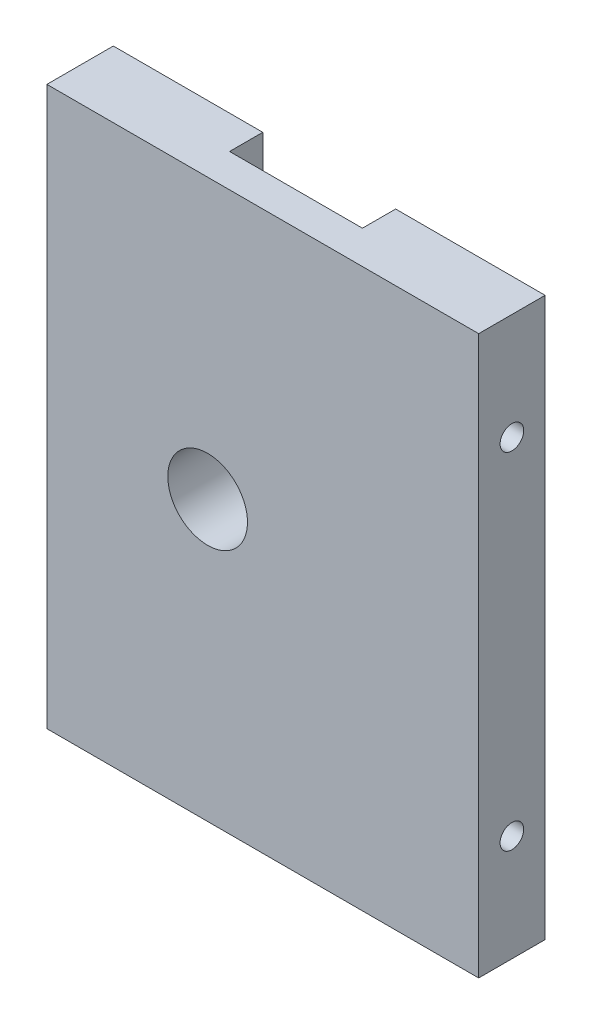
ISO-10303-21;
HEADER;
FILE_DESCRIPTION(('STEP AP214'),'2;1');
FILE_NAME('part.step','',(''),(''),'','','');
FILE_SCHEMA(('AUTOMOTIVE_DESIGN { 1 0 10303 214 1 1 1 1 }'));
ENDSEC;
DATA;
#1=APPLICATION_CONTEXT('core data for automotive mechanical design processes');
#2=APPLICATION_PROTOCOL_DEFINITION('international standard','automotive_design',2000,#1);
#3=PRODUCT_CONTEXT('',#1,'mechanical');
#4=PRODUCT('Part','Part','',(#3));
#5=PRODUCT_RELATED_PRODUCT_CATEGORY('part','',(#4));
#6=PRODUCT_DEFINITION_FORMATION('','',#4);
#7=PRODUCT_DEFINITION_CONTEXT('part definition',#1,'design');
#8=PRODUCT_DEFINITION('design','',#6,#7);
#9=PRODUCT_DEFINITION_SHAPE('','',#8);
#10=(LENGTH_UNIT() NAMED_UNIT(*) SI_UNIT(.MILLI.,.METRE.));
#11=(NAMED_UNIT(*) PLANE_ANGLE_UNIT() SI_UNIT($,.RADIAN.));
#12=(NAMED_UNIT(*) SI_UNIT($,.STERADIAN.) SOLID_ANGLE_UNIT());
#13=UNCERTAINTY_MEASURE_WITH_UNIT(LENGTH_MEASURE(1.E-05),#10,'distance_accuracy_value','');
#14=(GEOMETRIC_REPRESENTATION_CONTEXT(3) GLOBAL_UNCERTAINTY_ASSIGNED_CONTEXT((#13)) GLOBAL_UNIT_ASSIGNED_CONTEXT((#10,
#11,#12)) REPRESENTATION_CONTEXT('',''));
#15=CARTESIAN_POINT('',(0.,0.,0.));
#16=DIRECTION('',(0.,0.,1.));
#17=DIRECTION('',(1.,0.,0.));
#18=AXIS2_PLACEMENT_3D('',#15,#16,#17);
#19=CARTESIAN_POINT('',(0.,42.,5.));
#20=DIRECTION('',(0.,-1.,0.));
#21=DIRECTION('',(0.,0.,-1.));
#22=AXIS2_PLACEMENT_3D('',#19,#20,#21);
#23=PLANE('',#22);
#24=DIRECTION('',(0.,0.,-1.));
#25=VECTOR('',#24,1.);
#26=CARTESIAN_POINT('',(21.25,42.,2.5));
#27=LINE('',#26,#25);
#28=CARTESIAN_POINT('',(21.25,42.,2.5));
#29=VERTEX_POINT('',#28);
#30=CARTESIAN_POINT('',(21.25,42.,0.));
#31=VERTEX_POINT('',#30);
#32=EDGE_CURVE('E170',#29,#31,#27,.T.);
#33=ORIENTED_EDGE('',*,*,#32,.F.);
#34=DIRECTION('',(1.,0.,0.));
#35=VECTOR('',#34,1.);
#36=CARTESIAN_POINT('',(0.,42.,2.5));
#37=LINE('',#36,#35);
#38=CARTESIAN_POINT('',(11.25,42.,2.5));
#39=VERTEX_POINT('',#38);
#40=EDGE_CURVE('E149',#39,#29,#37,.T.);
#41=ORIENTED_EDGE('',*,*,#40,.F.);
#42=DIRECTION('',(0.,0.,-1.));
#43=VECTOR('',#42,1.);
#44=CARTESIAN_POINT('',(11.25,42.,2.5));
#45=LINE('',#44,#43);
#46=CARTESIAN_POINT('',(11.25,42.,0.));
#47=VERTEX_POINT('',#46);
#48=EDGE_CURVE('E174',#39,#47,#45,.T.);
#49=ORIENTED_EDGE('',*,*,#48,.T.);
#50=DIRECTION('',(-1.,0.,0.));
#51=VECTOR('',#50,1.);
#52=CARTESIAN_POINT('',(0.,42.,0.));
#53=LINE('',#52,#51);
#54=CARTESIAN_POINT('',(0.,42.,0.));
#55=VERTEX_POINT('',#54);
#56=EDGE_CURVE('E91',#47,#55,#53,.T.);
#57=ORIENTED_EDGE('',*,*,#56,.T.);
#58=DIRECTION('',(0.,0.,-1.));
#59=VECTOR('',#58,1.);
#60=CARTESIAN_POINT('',(0.,42.,5.));
#61=LINE('',#60,#59);
#62=CARTESIAN_POINT('',(0.,42.,5.));
#63=VERTEX_POINT('',#62);
#64=EDGE_CURVE('E230',#63,#55,#61,.T.);
#65=ORIENTED_EDGE('',*,*,#64,.F.);
#66=DIRECTION('',(-1.,0.,0.));
#67=VECTOR('',#66,1.);
#68=CARTESIAN_POINT('',(0.,42.,5.));
#69=LINE('',#68,#67);
#70=CARTESIAN_POINT('',(32.5,42.,5.));
#71=VERTEX_POINT('',#70);
#72=EDGE_CURVE('E70',#71,#63,#69,.T.);
#73=ORIENTED_EDGE('',*,*,#72,.F.);
#74=DIRECTION('',(0.,0.,-1.));
#75=VECTOR('',#74,1.);
#76=CARTESIAN_POINT('',(32.5,42.,5.));
#77=LINE('',#76,#75);
#78=CARTESIAN_POINT('',(32.5,42.,0.));
#79=VERTEX_POINT('',#78);
#80=EDGE_CURVE('E245',#71,#79,#77,.T.);
#81=ORIENTED_EDGE('',*,*,#80,.T.);
#82=EDGE_CURVE('E222',#79,#31,#53,.T.);
#83=ORIENTED_EDGE('',*,*,#82,.T.);
#84=EDGE_LOOP('',(#33,#41,#49,#57,#65,#73,#81,#83));
#85=FACE_BOUND('',#84,.T.);
#86=ADVANCED_FACE('F45',(#85),#23,.F.);
#87=CARTESIAN_POINT('',(0.,0.,0.));
#88=DIRECTION('',(0.,0.,-1.));
#89=DIRECTION('',(-1.,0.,0.));
#90=AXIS2_PLACEMENT_3D('',#87,#88,#89);
#91=PLANE('',#90);
#92=CARTESIAN_POINT('',(12.1,21.,0.));
#93=DIRECTION('',(0.,0.,-1.));
#94=DIRECTION('',(-1.,0.,0.));
#95=AXIS2_PLACEMENT_3D('',#92,#93,#94);
#96=CIRCLE('',#95,3.);
#97=CARTESIAN_POINT('',(9.1,21.,0.));
#98=VERTEX_POINT('',#97);
#99=EDGE_CURVE('E173',#98,#98,#96,.T.);
#100=ORIENTED_EDGE('',*,*,#99,.F.);
#101=EDGE_LOOP('',(#100));
#102=FACE_BOUND('',#101,.T.);
#103=DIRECTION('',(1.,0.,0.));
#104=VECTOR('',#103,1.);
#105=CARTESIAN_POINT('',(0.,35.5,0.));
#106=LINE('',#105,#104);
#107=CARTESIAN_POINT('',(11.25,35.5,0.));
#108=VERTEX_POINT('',#107);
#109=CARTESIAN_POINT('',(21.25,35.5,0.));
#110=VERTEX_POINT('',#109);
#111=EDGE_CURVE('E159',#108,#110,#106,.T.);
#112=ORIENTED_EDGE('',*,*,#111,.T.);
#113=DIRECTION('',(0.,1.,0.));
#114=VECTOR('',#113,1.);
#115=CARTESIAN_POINT('',(21.25,0.,0.));
#116=LINE('',#115,#114);
#117=EDGE_CURVE('E61',#110,#31,#116,.T.);
#118=ORIENTED_EDGE('',*,*,#117,.T.);
#119=ORIENTED_EDGE('',*,*,#82,.F.);
#120=DIRECTION('',(0.,1.,0.));
#121=VECTOR('',#120,1.);
#122=CARTESIAN_POINT('',(32.5,0.,0.));
#123=LINE('',#122,#121);
#124=CARTESIAN_POINT('',(32.5,0.,0.));
#125=VERTEX_POINT('',#124);
#126=EDGE_CURVE('E237',#125,#79,#123,.T.);
#127=ORIENTED_EDGE('',*,*,#126,.F.);
#128=DIRECTION('',(1.,0.,0.));
#129=VECTOR('',#128,1.);
#130=CARTESIAN_POINT('',(0.,0.,0.));
#131=LINE('',#130,#129);
#132=CARTESIAN_POINT('',(0.,0.,0.));
#133=VERTEX_POINT('',#132);
#134=EDGE_CURVE('E234',#133,#125,#131,.T.);
#135=ORIENTED_EDGE('',*,*,#134,.F.);
#136=DIRECTION('',(0.,-1.,0.));
#137=VECTOR('',#136,1.);
#138=CARTESIAN_POINT('',(0.,0.,0.));
#139=LINE('',#138,#137);
#140=EDGE_CURVE('E218',#55,#133,#139,.T.);
#141=ORIENTED_EDGE('',*,*,#140,.F.);
#142=ORIENTED_EDGE('',*,*,#56,.F.);
#143=DIRECTION('',(0.,-1.,0.));
#144=VECTOR('',#143,1.);
#145=CARTESIAN_POINT('',(11.25,0.,0.));
#146=LINE('',#145,#144);
#147=EDGE_CURVE('E155',#47,#108,#146,.T.);
#148=ORIENTED_EDGE('',*,*,#147,.T.);
#149=EDGE_LOOP('',(#112,#118,#119,#127,#135,#141,#142,#148));
#150=FACE_BOUND('',#149,.T.);
#151=ADVANCED_FACE('F257',(#102,#150),#91,.T.);
#152=CARTESIAN_POINT('',(0.,0.,5.));
#153=DIRECTION('',(1.,0.,0.));
#154=DIRECTION('',(0.,0.,-1.));
#155=AXIS2_PLACEMENT_3D('',#152,#153,#154);
#156=PLANE('',#155);
#157=CARTESIAN_POINT('',(0.,34.,2.5));
#158=DIRECTION('',(-1.,0.,0.));
#159=DIRECTION('',(0.,0.,1.));
#160=AXIS2_PLACEMENT_3D('',#157,#158,#159);
#161=CIRCLE('',#160,0.889000000000001);
#162=CARTESIAN_POINT('',(0.,34.,3.389));
#163=VERTEX_POINT('',#162);
#164=EDGE_CURVE('E202',#163,#163,#161,.T.);
#165=ORIENTED_EDGE('',*,*,#164,.F.);
#166=EDGE_LOOP('',(#165));
#167=FACE_BOUND('',#166,.T.);
#168=CARTESIAN_POINT('',(0.,8.,2.5));
#169=DIRECTION('',(-1.,0.,0.));
#170=DIRECTION('',(0.,0.,1.));
#171=AXIS2_PLACEMENT_3D('',#168,#169,#170);
#172=CIRCLE('',#171,0.888999999999999);
#173=CARTESIAN_POINT('',(0.,8.,3.389));
#174=VERTEX_POINT('',#173);
#175=EDGE_CURVE('E210',#174,#174,#172,.T.);
#176=ORIENTED_EDGE('',*,*,#175,.F.);
#177=EDGE_LOOP('',(#176));
#178=FACE_BOUND('',#177,.T.);
#179=ORIENTED_EDGE('',*,*,#140,.T.);
#180=DIRECTION('',(0.,0.,-1.));
#181=VECTOR('',#180,1.);
#182=CARTESIAN_POINT('',(0.,0.,5.));
#183=LINE('',#182,#181);
#184=CARTESIAN_POINT('',(0.,0.,5.));
#185=VERTEX_POINT('',#184);
#186=EDGE_CURVE('E11',#185,#133,#183,.T.);
#187=ORIENTED_EDGE('',*,*,#186,.F.);
#188=DIRECTION('',(0.,-1.,0.));
#189=VECTOR('',#188,1.);
#190=CARTESIAN_POINT('',(0.,0.,5.));
#191=LINE('',#190,#189);
#192=EDGE_CURVE('E219',#63,#185,#191,.T.);
#193=ORIENTED_EDGE('',*,*,#192,.F.);
#194=ORIENTED_EDGE('',*,*,#64,.T.);
#195=EDGE_LOOP('',(#179,#187,#193,#194));
#196=FACE_BOUND('',#195,.T.);
#197=ADVANCED_FACE('F47',(#167,#178,#196),#156,.F.);
#198=CARTESIAN_POINT('',(0.,0.,5.));
#199=DIRECTION('',(0.,1.,0.));
#200=DIRECTION('',(0.,0.,1.));
#201=AXIS2_PLACEMENT_3D('',#198,#199,#200);
#202=PLANE('',#201);
#203=ORIENTED_EDGE('',*,*,#134,.T.);
#204=DIRECTION('',(0.,0.,-1.));
#205=VECTOR('',#204,1.);
#206=CARTESIAN_POINT('',(32.5,0.,5.));
#207=LINE('',#206,#205);
#208=CARTESIAN_POINT('',(32.5,0.,5.));
#209=VERTEX_POINT('',#208);
#210=EDGE_CURVE('E54',#209,#125,#207,.T.);
#211=ORIENTED_EDGE('',*,*,#210,.F.);
#212=DIRECTION('',(1.,0.,0.));
#213=VECTOR('',#212,1.);
#214=CARTESIAN_POINT('',(0.,0.,5.));
#215=LINE('',#214,#213);
#216=EDGE_CURVE('E98',#185,#209,#215,.T.);
#217=ORIENTED_EDGE('',*,*,#216,.F.);
#218=ORIENTED_EDGE('',*,*,#186,.T.);
#219=EDGE_LOOP('',(#203,#211,#217,#218));
#220=FACE_BOUND('',#219,.T.);
#221=ADVANCED_FACE('F274',(#220),#202,.F.);
#222=CARTESIAN_POINT('',(32.5,0.,5.));
#223=DIRECTION('',(-1.,0.,0.));
#224=DIRECTION('',(0.,0.,1.));
#225=AXIS2_PLACEMENT_3D('',#222,#223,#224);
#226=PLANE('',#225);
#227=CARTESIAN_POINT('',(32.5,34.,2.5));
#228=DIRECTION('',(1.,0.,0.));
#229=DIRECTION('',(0.,0.,-1.));
#230=AXIS2_PLACEMENT_3D('',#227,#228,#229);
#231=CIRCLE('',#230,0.888999999999987);
#232=CARTESIAN_POINT('',(32.5,34.,1.61100000000001));
#233=VERTEX_POINT('',#232);
#234=EDGE_CURVE('E183',#233,#233,#231,.T.);
#235=ORIENTED_EDGE('',*,*,#234,.F.);
#236=EDGE_LOOP('',(#235));
#237=FACE_BOUND('',#236,.T.);
#238=CARTESIAN_POINT('',(32.5,8.,2.5));
#239=DIRECTION('',(1.,0.,0.));
#240=DIRECTION('',(0.,0.,-1.));
#241=AXIS2_PLACEMENT_3D('',#238,#239,#240);
#242=CIRCLE('',#241,0.888999999999989);
#243=CARTESIAN_POINT('',(32.5,8.,1.61100000000001));
#244=VERTEX_POINT('',#243);
#245=EDGE_CURVE('E194',#244,#244,#242,.T.);
#246=ORIENTED_EDGE('',*,*,#245,.F.);
#247=EDGE_LOOP('',(#246));
#248=FACE_BOUND('',#247,.T.);
#249=ORIENTED_EDGE('',*,*,#126,.T.);
#250=ORIENTED_EDGE('',*,*,#80,.F.);
#251=DIRECTION('',(0.,1.,0.));
#252=VECTOR('',#251,1.);
#253=CARTESIAN_POINT('',(32.5,0.,5.));
#254=LINE('',#253,#252);
#255=EDGE_CURVE('E225',#209,#71,#254,.T.);
#256=ORIENTED_EDGE('',*,*,#255,.F.);
#257=ORIENTED_EDGE('',*,*,#210,.T.);
#258=EDGE_LOOP('',(#249,#250,#256,#257));
#259=FACE_BOUND('',#258,.T.);
#260=ADVANCED_FACE('F253',(#237,#248,#259),#226,.F.);
#261=CARTESIAN_POINT('',(0.,0.,5.));
#262=DIRECTION('',(0.,0.,-1.));
#263=DIRECTION('',(-1.,0.,0.));
#264=AXIS2_PLACEMENT_3D('',#261,#262,#263);
#265=PLANE('',#264);
#266=CARTESIAN_POINT('',(12.1,21.,5.));
#267=DIRECTION('',(0.,0.,-1.));
#268=DIRECTION('',(-1.,0.,0.));
#269=AXIS2_PLACEMENT_3D('',#266,#267,#268);
#270=CIRCLE('',#269,3.);
#271=CARTESIAN_POINT('',(9.1,21.,5.));
#272=VERTEX_POINT('',#271);
#273=EDGE_CURVE('E179',#272,#272,#270,.T.);
#274=ORIENTED_EDGE('',*,*,#273,.T.);
#275=EDGE_LOOP('',(#274));
#276=FACE_BOUND('',#275,.T.);
#277=ORIENTED_EDGE('',*,*,#192,.T.);
#278=ORIENTED_EDGE('',*,*,#216,.T.);
#279=ORIENTED_EDGE('',*,*,#255,.T.);
#280=ORIENTED_EDGE('',*,*,#72,.T.);
#281=EDGE_LOOP('',(#277,#278,#279,#280));
#282=FACE_BOUND('',#281,.T.);
#283=ADVANCED_FACE('F262',(#276,#282),#265,.F.);
#284=CARTESIAN_POINT('',(7.4658349096845,8.,2.5));
#285=DIRECTION('',(-1.,0.,0.));
#286=DIRECTION('',(0.,0.,1.));
#287=AXIS2_PLACEMENT_3D('',#284,#285,#286);
#288=CONICAL_SURFACE('',#287,0.888999999999999,1.02974425867665);
#289=CARTESIAN_POINT('',(8.,8.,2.5));
#290=VERTEX_POINT('',#289);
#291=VERTEX_LOOP('',#290);
#292=FACE_BOUND('',#291,.T.);
#293=CARTESIAN_POINT('',(7.4658349096845,8.,2.5));
#294=DIRECTION('',(-1.,0.,0.));
#295=DIRECTION('',(0.,0.,1.));
#296=AXIS2_PLACEMENT_3D('',#293,#294,#295);
#297=CIRCLE('',#296,0.888999999999999);
#298=CARTESIAN_POINT('',(7.4658349096845,8.,3.389));
#299=VERTEX_POINT('',#298);
#300=EDGE_CURVE('E214',#299,#299,#297,.T.);
#301=ORIENTED_EDGE('',*,*,#300,.T.);
#302=EDGE_LOOP('',(#301));
#303=FACE_BOUND('',#302,.T.);
#304=ADVANCED_FACE('F264',(#292,#303),#288,.F.);
#305=CARTESIAN_POINT('',(0.,8.,2.5));
#306=DIRECTION('',(-1.,0.,0.));
#307=DIRECTION('',(0.,0.,1.));
#308=AXIS2_PLACEMENT_3D('',#305,#306,#307);
#309=CYLINDRICAL_SURFACE('',#308,0.888999999999999);
#310=ORIENTED_EDGE('',*,*,#300,.F.);
#311=EDGE_LOOP('',(#310));
#312=FACE_BOUND('',#311,.T.);
#313=ORIENTED_EDGE('',*,*,#175,.T.);
#314=EDGE_LOOP('',(#313));
#315=FACE_BOUND('',#314,.T.);
#316=ADVANCED_FACE('F271',(#312,#315),#309,.F.);
#317=CARTESIAN_POINT('',(7.4658349096845,34.,2.5));
#318=DIRECTION('',(-1.,0.,0.));
#319=DIRECTION('',(0.,0.,1.));
#320=AXIS2_PLACEMENT_3D('',#317,#318,#319);
#321=CONICAL_SURFACE('',#320,0.889000000000001,1.02974425867665);
#322=CARTESIAN_POINT('',(8.,34.,2.5));
#323=VERTEX_POINT('',#322);
#324=VERTEX_LOOP('',#323);
#325=FACE_BOUND('',#324,.T.);
#326=CARTESIAN_POINT('',(7.4658349096845,34.,2.5));
#327=DIRECTION('',(-1.,0.,0.));
#328=DIRECTION('',(0.,0.,1.));
#329=AXIS2_PLACEMENT_3D('',#326,#327,#328);
#330=CIRCLE('',#329,0.889000000000001);
#331=CARTESIAN_POINT('',(7.4658349096845,34.,3.389));
#332=VERTEX_POINT('',#331);
#333=EDGE_CURVE('E206',#332,#332,#330,.T.);
#334=ORIENTED_EDGE('',*,*,#333,.T.);
#335=EDGE_LOOP('',(#334));
#336=FACE_BOUND('',#335,.T.);
#337=ADVANCED_FACE('F325',(#325,#336),#321,.F.);
#338=CARTESIAN_POINT('',(0.,34.,2.5));
#339=DIRECTION('',(-1.,0.,0.));
#340=DIRECTION('',(0.,0.,1.));
#341=AXIS2_PLACEMENT_3D('',#338,#339,#340);
#342=CYLINDRICAL_SURFACE('',#341,0.889000000000001);
#343=ORIENTED_EDGE('',*,*,#333,.F.);
#344=EDGE_LOOP('',(#343));
#345=FACE_BOUND('',#344,.T.);
#346=ORIENTED_EDGE('',*,*,#164,.T.);
#347=EDGE_LOOP('',(#346));
#348=FACE_BOUND('',#347,.T.);
#349=ADVANCED_FACE('F321',(#345,#348),#342,.F.);
#350=CARTESIAN_POINT('',(25.0341650903155,8.,2.5));
#351=DIRECTION('',(1.,0.,0.));
#352=DIRECTION('',(0.,0.,-1.));
#353=AXIS2_PLACEMENT_3D('',#350,#351,#352);
#354=CONICAL_SURFACE('',#353,0.888999999999999,1.02974425867665);
#355=CARTESIAN_POINT('',(24.5,8.,2.5));
#356=VERTEX_POINT('',#355);
#357=VERTEX_LOOP('',#356);
#358=FACE_BOUND('',#357,.T.);
#359=CARTESIAN_POINT('',(25.0341650903155,8.,2.5));
#360=DIRECTION('',(1.,0.,0.));
#361=DIRECTION('',(0.,0.,-1.));
#362=AXIS2_PLACEMENT_3D('',#359,#360,#361);
#363=CIRCLE('',#362,0.888999999999999);
#364=CARTESIAN_POINT('',(25.0341650903155,8.,1.611));
#365=VERTEX_POINT('',#364);
#366=EDGE_CURVE('E198',#365,#365,#363,.T.);
#367=ORIENTED_EDGE('',*,*,#366,.T.);
#368=EDGE_LOOP('',(#367));
#369=FACE_BOUND('',#368,.T.);
#370=ADVANCED_FACE('F317',(#358,#369),#354,.F.);
#371=CARTESIAN_POINT('',(32.5,8.,2.5));
#372=DIRECTION('',(1.,0.,0.));
#373=DIRECTION('',(0.,0.,-1.));
#374=AXIS2_PLACEMENT_3D('',#371,#372,#373);
#375=CYLINDRICAL_SURFACE('',#374,0.888999999999994);
#376=ORIENTED_EDGE('',*,*,#366,.F.);
#377=EDGE_LOOP('',(#376));
#378=FACE_BOUND('',#377,.T.);
#379=ORIENTED_EDGE('',*,*,#245,.T.);
#380=EDGE_LOOP('',(#379));
#381=FACE_BOUND('',#380,.T.);
#382=ADVANCED_FACE('F313',(#378,#381),#375,.F.);
#383=CARTESIAN_POINT('',(25.0341650903155,34.,2.5));
#384=DIRECTION('',(1.,0.,0.));
#385=DIRECTION('',(0.,0.,-1.));
#386=AXIS2_PLACEMENT_3D('',#383,#384,#385);
#387=CONICAL_SURFACE('',#386,0.889000000000001,1.02974425867665);
#388=CARTESIAN_POINT('',(24.5,34.,2.5));
#389=VERTEX_POINT('',#388);
#390=VERTEX_LOOP('',#389);
#391=FACE_BOUND('',#390,.T.);
#392=CARTESIAN_POINT('',(25.0341650903155,34.,2.5));
#393=DIRECTION('',(1.,0.,0.));
#394=DIRECTION('',(0.,0.,-1.));
#395=AXIS2_PLACEMENT_3D('',#392,#393,#394);
#396=CIRCLE('',#395,0.889000000000001);
#397=CARTESIAN_POINT('',(25.0341650903155,34.,1.611));
#398=VERTEX_POINT('',#397);
#399=EDGE_CURVE('E190',#398,#398,#396,.T.);
#400=ORIENTED_EDGE('',*,*,#399,.T.);
#401=EDGE_LOOP('',(#400));
#402=FACE_BOUND('',#401,.T.);
#403=ADVANCED_FACE('F309',(#391,#402),#387,.F.);
#404=CARTESIAN_POINT('',(32.5,34.,2.5));
#405=DIRECTION('',(1.,0.,0.));
#406=DIRECTION('',(0.,0.,-1.));
#407=AXIS2_PLACEMENT_3D('',#404,#405,#406);
#408=CYLINDRICAL_SURFACE('',#407,0.888999999999994);
#409=ORIENTED_EDGE('',*,*,#399,.F.);
#410=EDGE_LOOP('',(#409));
#411=FACE_BOUND('',#410,.T.);
#412=ORIENTED_EDGE('',*,*,#234,.T.);
#413=EDGE_LOOP('',(#412));
#414=FACE_BOUND('',#413,.T.);
#415=ADVANCED_FACE('F305',(#411,#414),#408,.F.);
#416=CARTESIAN_POINT('',(12.1,21.,5.));
#417=DIRECTION('',(0.,0.,-1.));
#418=DIRECTION('',(-1.,0.,0.));
#419=AXIS2_PLACEMENT_3D('',#416,#417,#418);
#420=CYLINDRICAL_SURFACE('',#419,3.);
#421=ORIENTED_EDGE('',*,*,#273,.F.);
#422=EDGE_LOOP('',(#421));
#423=FACE_BOUND('',#422,.T.);
#424=ORIENTED_EDGE('',*,*,#99,.T.);
#425=EDGE_LOOP('',(#424));
#426=FACE_BOUND('',#425,.T.);
#427=ADVANCED_FACE('F299',(#423,#426),#420,.F.);
#428=CARTESIAN_POINT('',(21.25,0.,2.5));
#429=DIRECTION('',(-1.,0.,0.));
#430=DIRECTION('',(0.,0.,1.));
#431=AXIS2_PLACEMENT_3D('',#428,#429,#430);
#432=PLANE('',#431);
#433=ORIENTED_EDGE('',*,*,#117,.F.);
#434=DIRECTION('',(0.,0.,-1.));
#435=VECTOR('',#434,1.);
#436=CARTESIAN_POINT('',(21.25,35.5,2.5));
#437=LINE('',#436,#435);
#438=CARTESIAN_POINT('',(21.25,35.5,2.5));
#439=VERTEX_POINT('',#438);
#440=EDGE_CURVE('E136',#439,#110,#437,.T.);
#441=ORIENTED_EDGE('',*,*,#440,.F.);
#442=DIRECTION('',(0.,1.,0.));
#443=VECTOR('',#442,1.);
#444=CARTESIAN_POINT('',(21.25,0.,2.5));
#445=LINE('',#444,#443);
#446=EDGE_CURVE('E144',#439,#29,#445,.T.);
#447=ORIENTED_EDGE('',*,*,#446,.T.);
#448=ORIENTED_EDGE('',*,*,#32,.T.);
#449=EDGE_LOOP('',(#433,#441,#447,#448));
#450=FACE_BOUND('',#449,.T.);
#451=ADVANCED_FACE('F146',(#450),#432,.T.);
#452=CARTESIAN_POINT('',(11.25,0.,2.5));
#453=DIRECTION('',(1.,0.,0.));
#454=DIRECTION('',(0.,0.,-1.));
#455=AXIS2_PLACEMENT_3D('',#452,#453,#454);
#456=PLANE('',#455);
#457=ORIENTED_EDGE('',*,*,#147,.F.);
#458=ORIENTED_EDGE('',*,*,#48,.F.);
#459=DIRECTION('',(0.,-1.,0.));
#460=VECTOR('',#459,1.);
#461=CARTESIAN_POINT('',(11.25,0.,2.5));
#462=LINE('',#461,#460);
#463=CARTESIAN_POINT('',(11.25,35.5,2.5));
#464=VERTEX_POINT('',#463);
#465=EDGE_CURVE('E143',#39,#464,#462,.T.);
#466=ORIENTED_EDGE('',*,*,#465,.T.);
#467=DIRECTION('',(0.,0.,-1.));
#468=VECTOR('',#467,1.);
#469=CARTESIAN_POINT('',(11.25,35.5,2.5));
#470=LINE('',#469,#468);
#471=EDGE_CURVE('E138',#464,#108,#470,.T.);
#472=ORIENTED_EDGE('',*,*,#471,.T.);
#473=EDGE_LOOP('',(#457,#458,#466,#472));
#474=FACE_BOUND('',#473,.T.);
#475=ADVANCED_FACE('F291',(#474),#456,.T.);
#476=CARTESIAN_POINT('',(0.,35.5,2.5));
#477=DIRECTION('',(0.,1.,0.));
#478=DIRECTION('',(0.,0.,1.));
#479=AXIS2_PLACEMENT_3D('',#476,#477,#478);
#480=PLANE('',#479);
#481=ORIENTED_EDGE('',*,*,#111,.F.);
#482=ORIENTED_EDGE('',*,*,#471,.F.);
#483=DIRECTION('',(1.,0.,0.));
#484=VECTOR('',#483,1.);
#485=CARTESIAN_POINT('',(0.,35.5,2.5));
#486=LINE('',#485,#484);
#487=EDGE_CURVE('E133',#464,#439,#486,.T.);
#488=ORIENTED_EDGE('',*,*,#487,.T.);
#489=ORIENTED_EDGE('',*,*,#440,.T.);
#490=EDGE_LOOP('',(#481,#482,#488,#489));
#491=FACE_BOUND('',#490,.T.);
#492=ADVANCED_FACE('F135',(#491),#480,.T.);
#493=CARTESIAN_POINT('',(0.,0.,2.5));
#494=DIRECTION('',(0.,0.,-1.));
#495=DIRECTION('',(-1.,0.,0.));
#496=AXIS2_PLACEMENT_3D('',#493,#494,#495);
#497=PLANE('',#496);
#498=ORIENTED_EDGE('',*,*,#446,.F.);
#499=ORIENTED_EDGE('',*,*,#487,.F.);
#500=ORIENTED_EDGE('',*,*,#465,.F.);
#501=ORIENTED_EDGE('',*,*,#40,.T.);
#502=EDGE_LOOP('',(#498,#499,#500,#501));
#503=FACE_BOUND('',#502,.T.);
#504=ADVANCED_FACE('F151',(#503),#497,.T.);
#505=CLOSED_SHELL('',(#86,#151,#197,#221,#260,#283,#304,#316,#337,#349,#370,#382,#403,#415,#427,
#451,#475,#492,#504));
#506=MANIFOLD_SOLID_BREP('B2',#505);
#507=ADVANCED_BREP_SHAPE_REPRESENTATION('',(#18,#506),#14);
#508=SHAPE_DEFINITION_REPRESENTATION(#9,#507);
ENDSEC;
END-ISO-10303-21;
